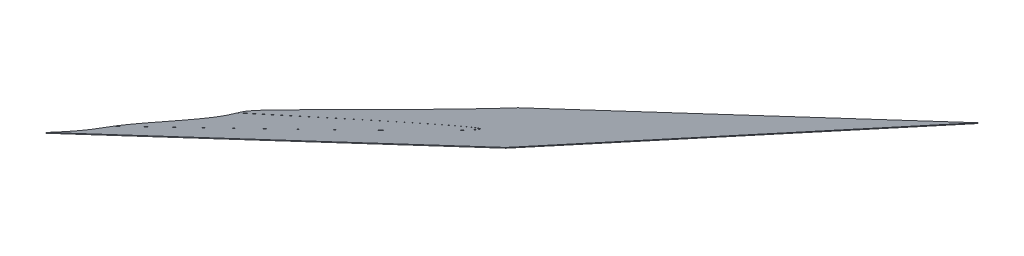
ISO-10303-21;
HEADER;
FILE_DESCRIPTION(('STEP AP214'),'2;1');
FILE_NAME('part.step','',(''),(''),'','','');
FILE_SCHEMA(('AUTOMOTIVE_DESIGN { 1 0 10303 214 1 1 1 1 }'));
ENDSEC;
DATA;
#1=APPLICATION_CONTEXT('core data for automotive mechanical design processes');
#2=APPLICATION_PROTOCOL_DEFINITION('international standard','automotive_design',2000,#1);
#3=PRODUCT_CONTEXT('',#1,'mechanical');
#4=PRODUCT('Part','Part','',(#3));
#5=PRODUCT_RELATED_PRODUCT_CATEGORY('part','',(#4));
#6=PRODUCT_DEFINITION_FORMATION('','',#4);
#7=PRODUCT_DEFINITION_CONTEXT('part definition',#1,'design');
#8=PRODUCT_DEFINITION('design','',#6,#7);
#9=PRODUCT_DEFINITION_SHAPE('','',#8);
#10=(LENGTH_UNIT() NAMED_UNIT(*) SI_UNIT(.MILLI.,.METRE.));
#11=(NAMED_UNIT(*) PLANE_ANGLE_UNIT() SI_UNIT($,.RADIAN.));
#12=(NAMED_UNIT(*) SI_UNIT($,.STERADIAN.) SOLID_ANGLE_UNIT());
#13=UNCERTAINTY_MEASURE_WITH_UNIT(LENGTH_MEASURE(1.E-05),#10,'distance_accuracy_value','');
#14=(GEOMETRIC_REPRESENTATION_CONTEXT(3) GLOBAL_UNCERTAINTY_ASSIGNED_CONTEXT((#13)) GLOBAL_UNIT_ASSIGNED_CONTEXT((#10,
#11,#12)) REPRESENTATION_CONTEXT('',''));
#15=CARTESIAN_POINT('',(0.,0.,0.));
#16=DIRECTION('',(0.,0.,1.));
#17=DIRECTION('',(1.,0.,0.));
#18=AXIS2_PLACEMENT_3D('',#15,#16,#17);
#19=CARTESIAN_POINT('',(1568.46992706819,389.379831950882,323.539097415844));
#20=CARTESIAN_POINT('',(1568.16414088397,389.714655714311,324.599592016166));
#21=CARTESIAN_POINT('',(1567.14624705832,390.171824813787,326.666592082493));
#22=CARTESIAN_POINT('',(1566.45869706116,390.311092375658,327.68544206741));
#23=CARTESIAN_POINT('',(1565.83932263441,390.436550548379,328.60326568454));
#24=CARTESIAN_POINT('',(1565.05166459567,390.498145343994,329.552452083646));
#25=CARTESIAN_POINT('',(1564.34024781227,390.553778079539,330.409762111201));
#26=CARTESIAN_POINT('',(1563.48214701023,390.558031169865,331.303950443254));
#27=CARTESIAN_POINT('',(1562.7161058719,390.561827975725,332.102207531619));
#28=CARTESIAN_POINT('',(1561.82054871175,390.524707212132,332.942927899901));
#29=CARTESIAN_POINT('',(1561.01430701408,390.491288566411,333.699801773673));
#30=CARTESIAN_POINT('',(1560.08314895562,390.423815124447,334.509671136521));
#31=CARTESIAN_POINT('',(1559.25747652285,390.363985366794,335.227794983459));
#32=CARTESIAN_POINT('',(1558.29560589706,390.27450240134,336.020342830274));
#33=CARTESIAN_POINT('',(1557.48892218456,390.199456497199,336.685022073266));
#34=CARTESIAN_POINT('',(1556.49137678576,390.094408169479,337.479707412954));
#35=CARTESIAN_POINT('',(1556.08494958628,390.051608615999,337.803483892161));
#36=CARTESIAN_POINT('',(1555.58481378326,389.997322579488,338.198310529932));
#37=CARTESIAN_POINT('',(1555.28610191312,389.964899618782,338.434125287923));
#38=CARTESIAN_POINT('',(1554.07095749592,389.831654406697,339.39040215781));
#39=CARTESIAN_POINT('',(1553.76753453117,389.798817208625,339.630152191706));
#40=CARTESIAN_POINT('',(1553.25119700232,389.742937859741,340.038136933886));
#41=CARTESIAN_POINT('',(1552.85983179049,389.702454506114,340.351539346196));
#42=CARTESIAN_POINT('',(1552.36048757215,389.650801656137,340.751410560781));
#43=CARTESIAN_POINT('',(1551.95601480371,389.612873698344,341.084014752642));
#44=CARTESIAN_POINT('',(1551.46334136448,389.566675044523,341.489147715582));
#45=CARTESIAN_POINT('',(1551.06038029617,389.536003290236,341.836343540348));
#46=CARTESIAN_POINT('',(1550.5738821321,389.498973032668,342.255515873876));
#47=CARTESIAN_POINT('',(1550.18366711276,389.4819272845,342.619897809679));
#48=CARTESIAN_POINT('',(1549.71062716311,389.461263497984,343.061621485145));
#49=CARTESIAN_POINT('',(1549.35005268598,389.468716683353,343.449970934165));
#50=CARTESIAN_POINT('',(1548.90655052278,389.477884009504,343.927635970491));
#51=CARTESIAN_POINT('',(1548.42674696526,389.561142596096,344.60763453266));
#52=CARTESIAN_POINT('',(1548.14581584088,389.658260267835,345.11343727996));
#53=CARTESIAN_POINT('',(1547.94392001205,389.80256098229,345.642768716615));
#54=CARTESIAN_POINT('',(1547.83849681698,389.99629074387,346.182649498274));
#55=CARTESIAN_POINT('',(1547.82946100776,390.232630565954,346.71799040574));
#56=CARTESIAN_POINT('',(1547.90164157936,390.499158571045,347.236785560455));
#57=CARTESIAN_POINT('',(1548.0890280721,390.903049279313,347.942530740097));
#58=CARTESIAN_POINT('',(1548.31590433077,391.238764710358,348.455822392337));
#59=CARTESIAN_POINT('',(1548.49744419471,391.507394553029,348.866543625364));
#60=CARTESIAN_POINT('',(1548.76118559021,391.846737621925,349.349900535017));
#61=CARTESIAN_POINT('',(1548.97312053249,392.119423878037,349.738312140087));
#62=CARTESIAN_POINT('',(1549.25565402692,392.460236002843,350.205563650248));
#63=CARTESIAN_POINT('',(1549.47916798983,392.729854544094,350.575209156958));
#64=CARTESIAN_POINT('',(1549.77708347704,393.078396941766,351.043806843739));
#65=B_SPLINE_CURVE_WITH_KNOTS('',2,(#19,#20,#21,#22,#23,#24,#25,#26,#27,#28,#29,#30,#31,#32,#33,
#34,#35,#36,#37,#38,#39,#40,#41,#42,#43,#44,#45,#46,#47,#48,#49,#50,#51,#52,#53,#54,#55,#56,#57,
#58,#59,#60,#61,#62,#63,#64),.UNSPECIFIED.,.F.,.F.,(3,1,2,2,2,2,2,2,2,2,1,2,2,2,2,2,2,1,1,1,1,1,
1,1,2,2,2,3),(0.,0.0625,0.125,0.1875,0.25,0.3125,0.375,0.4375,0.5,0.53125,0.5625,0.59375,0.625,
0.65625,0.6875,0.71875,0.75,0.78125,0.796875,0.8125,0.828125,0.84375,0.859375,0.875,0.90625,
0.9375,0.96875,1.),.UNSPECIFIED.);
#66=DIRECTION('',(0.389223194218151,-0.840232362196237,0.377511433735126));
#67=VECTOR('',#66,1.);
#68=SURFACE_OF_LINEAR_EXTRUSION('',#65,#67);
#69=CARTESIAN_POINT('',(1568.50884938761,389.295808714663,323.576848559218));
#70=CARTESIAN_POINT('',(1568.20306320339,389.630632478092,324.637343159539));
#71=CARTESIAN_POINT('',(1567.18516937774,390.087801577568,326.704343225867));
#72=CARTESIAN_POINT('',(1566.49761938058,390.227069139438,327.723193210784));
#73=CARTESIAN_POINT('',(1565.87824495383,390.352527312159,328.641016827914));
#74=CARTESIAN_POINT('',(1565.09058691509,390.414122107774,329.590203227019));
#75=CARTESIAN_POINT('',(1564.37917013169,390.46975484332,330.447513254575));
#76=CARTESIAN_POINT('',(1563.52106932965,390.474007933645,331.341701586627));
#77=CARTESIAN_POINT('',(1562.75502819133,390.477804739505,332.139958674992));
#78=CARTESIAN_POINT('',(1561.85947103117,390.440683975912,332.980679043275));
#79=CARTESIAN_POINT('',(1561.0532293335,390.407265330191,333.737552917047));
#80=CARTESIAN_POINT('',(1560.12207127504,390.339791888227,334.547422279895));
#81=CARTESIAN_POINT('',(1559.29639884228,390.279962130574,335.265546126833));
#82=CARTESIAN_POINT('',(1558.33452821648,390.19047916512,336.058093973648));
#83=CARTESIAN_POINT('',(1557.52784450398,390.11543326098,336.72277321664));
#84=CARTESIAN_POINT('',(1556.53029910518,390.01038493326,337.517458556327));
#85=CARTESIAN_POINT('',(1556.1238719057,389.96758537978,337.841235035535));
#86=CARTESIAN_POINT('',(1555.62373610269,389.913299343269,338.236061673305));
#87=CARTESIAN_POINT('',(1555.32502423254,389.880876382562,338.471876431297));
#88=CARTESIAN_POINT('',(1554.10987981534,389.747631170477,339.428153301184));
#89=CARTESIAN_POINT('',(1553.80645685059,389.714793972406,339.66790333508));
#90=CARTESIAN_POINT('',(1553.29011932174,389.658914623521,340.07588807726));
#91=CARTESIAN_POINT('',(1552.89875410991,389.618431269894,340.38929048957));
#92=CARTESIAN_POINT('',(1552.39940989157,389.566778419917,340.789161704154));
#93=CARTESIAN_POINT('',(1551.99493712313,389.528850462124,341.121765896015));
#94=CARTESIAN_POINT('',(1551.5022636839,389.482651808304,341.526898858955));
#95=CARTESIAN_POINT('',(1551.0993026156,389.451980054017,341.874094683722));
#96=CARTESIAN_POINT('',(1550.61280445152,389.414949796448,342.293267017249));
#97=CARTESIAN_POINT('',(1550.22258943218,389.397904048281,342.657648953053));
#98=CARTESIAN_POINT('',(1549.74954948253,389.377240261765,343.099372628518));
#99=CARTESIAN_POINT('',(1549.3889750054,389.384693447133,343.487722077538));
#100=CARTESIAN_POINT('',(1548.9454728422,389.393860773284,343.965387113864));
#101=CARTESIAN_POINT('',(1548.46566928468,389.477119359877,344.645385676033));
#102=CARTESIAN_POINT('',(1548.18473816031,389.574237031615,345.151188423334));
#103=CARTESIAN_POINT('',(1547.98284233147,389.71853774607,345.680519859989));
#104=CARTESIAN_POINT('',(1547.8774191364,389.91226750765,346.220400641647));
#105=CARTESIAN_POINT('',(1547.86838332719,390.148607329734,346.755741549113));
#106=CARTESIAN_POINT('',(1547.94056389878,390.415135334825,347.274536703828));
#107=CARTESIAN_POINT('',(1548.12795039153,390.819026043093,347.980281883471));
#108=CARTESIAN_POINT('',(1548.3548266502,391.154741474138,348.49357353571));
#109=CARTESIAN_POINT('',(1548.53636651413,391.423371316809,348.904294768738));
#110=CARTESIAN_POINT('',(1548.80010790963,391.762714385705,349.387651678391));
#111=CARTESIAN_POINT('',(1549.01204285191,392.035400641817,349.77606328346));
#112=CARTESIAN_POINT('',(1549.29457634634,392.376212766623,350.243314793622));
#113=CARTESIAN_POINT('',(1549.51809030925,392.645831307874,350.612960300331));
#114=CARTESIAN_POINT('',(1549.81600579646,392.994373705547,351.081557987113));
#115=B_SPLINE_CURVE_WITH_KNOTS('',2,(#69,#70,#71,#72,#73,#74,#75,#76,#77,#78,#79,#80,#81,#82,
#83,#84,#85,#86,#87,#88,#89,#90,#91,#92,#93,#94,#95,#96,#97,#98,#99,#100,#101,#102,#103,#104,
#105,#106,#107,#108,#109,#110,#111,#112,#113,#114),.UNSPECIFIED.,.F.,.F.,(3,1,2,2,2,2,2,2,2,2,1,
2,2,2,2,2,2,1,1,1,1,1,1,1,2,2,2,3),(0.,0.0625,0.125,0.1875,0.25,0.3125,0.375,0.4375,0.5,0.53125,
0.5625,0.59375,0.625,0.65625,0.6875,0.71875,0.75,0.78125,0.796875,0.8125,0.828125,0.84375,
0.859375,0.875,0.90625,0.9375,0.96875,1.),.UNSPECIFIED.);
#116=CARTESIAN_POINT('',(1568.50884938761,389.295808714662,323.576848559218));
#117=VERTEX_POINT('',#116);
#118=CARTESIAN_POINT('',(1549.81600545331,392.994373304075,351.081557447355));
#119=VERTEX_POINT('',#118);
#120=EDGE_CURVE('E183',#117,#119,#115,.T.);
#121=ORIENTED_EDGE('',*,*,#120,.T.);
#122=DIRECTION('',(0.389223194218151,-0.840232362196237,0.377511433735126));
#123=VECTOR('',#122,1.);
#124=CARTESIAN_POINT('',(1549.77708313389,393.078396540295,351.043806303981));
#125=LINE('',#124,#123);
#126=CARTESIAN_POINT('',(1549.77708313389,393.078396540295,351.043806303981));
#127=VERTEX_POINT('',#126);
#128=EDGE_CURVE('E13',#127,#119,#125,.T.);
#129=ORIENTED_EDGE('',*,*,#128,.F.);
#130=CARTESIAN_POINT('',(1568.46992706819,389.379831950882,323.539097415844));
#131=VERTEX_POINT('',#130);
#132=EDGE_CURVE('E251',#131,#127,#65,.T.);
#133=ORIENTED_EDGE('',*,*,#132,.F.);
#134=DIRECTION('',(0.389223194218151,-0.840232362196237,0.377511433735126));
#135=VECTOR('',#134,1.);
#136=CARTESIAN_POINT('',(1568.46992706819,389.379831950882,323.539097415844));
#137=LINE('',#136,#135);
#138=EDGE_CURVE('E182',#131,#117,#137,.T.);
#139=ORIENTED_EDGE('',*,*,#138,.T.);
#140=EDGE_LOOP('',(#121,#129,#133,#139));
#141=FACE_BOUND('',#140,.T.);
#142=ADVANCED_FACE('F58',(#141),#68,.F.);
#143=CARTESIAN_POINT('',(1549.77708347704,393.078396941765,351.043806843738));
#144=CARTESIAN_POINT('',(1550.51896713318,393.477868421516,351.168016429167));
#145=CARTESIAN_POINT('',(1551.48260946601,393.984764794518,351.302684641745));
#146=CARTESIAN_POINT('',(1552.24581598965,394.386227666691,351.409342117103));
#147=CARTESIAN_POINT('',(1553.1968685208,394.880733886271,351.529413778262));
#148=CARTESIAN_POINT('',(1554.56849032749,395.59391795561,351.702582876096));
#149=CARTESIAN_POINT('',(1556.63675708978,396.65907739575,351.940890987461));
#150=CARTESIAN_POINT('',(1557.75328108774,397.234088365448,352.069538186218));
#151=CARTESIAN_POINT('',(1562.39435123865,399.619090597236,352.59281746382));
#152=CARTESIAN_POINT('',(1563.52903471563,400.202932700363,352.722397385785));
#153=CARTESIAN_POINT('',(1565.41534047265,401.173515900582,352.937811955358));
#154=CARTESIAN_POINT('',(1566.97311378613,401.977874133011,353.121982040109));
#155=CARTESIAN_POINT('',(1568.79517709179,402.918698839167,353.337398205299));
#156=CARTESIAN_POINT('',(1570.59908323614,403.855229280311,353.561977027764));
#157=CARTESIAN_POINT('',(1574.1445289118,405.697247476923,354.006343991916));
#158=CARTESIAN_POINT('',(1577.1172601634,407.265979854291,354.432937052148));
#159=CARTESIAN_POINT('',(1577.45184742729,407.442716746908,354.481335409242));
#160=CARTESIAN_POINT('',(1580.98923558462,409.313600398953,354.998256103897));
#161=CARTESIAN_POINT('',(1583.91934112642,410.90603376474,355.52154889067));
#162=CARTESIAN_POINT('',(1584.25487862614,411.088702844731,355.582170882787));
#163=CARTESIAN_POINT('',(1587.84136275895,413.045714246255,356.240168178674));
#164=CARTESIAN_POINT('',(1590.61626721705,414.641951335117,356.931942942637));
#165=CARTESIAN_POINT('',(1592.55161715252,415.759186470631,357.423197025712));
#166=CARTESIAN_POINT('',(1594.00834400245,416.648873129688,357.901465044596));
#167=CARTESIAN_POINT('',(1595.82081584295,417.755828779251,358.496530149956));
#168=CARTESIAN_POINT('',(1597.1198544099,418.642445106104,359.130544828308));
#169=CARTESIAN_POINT('',(1598.93142482296,419.878873297178,360.014708133365));
#170=CARTESIAN_POINT('',(1599.76626577104,420.70199686166,360.986004798115));
#171=CARTESIAN_POINT('',(1600.3973079293,421.324182047775,361.720191525606));
#172=CARTESIAN_POINT('',(1600.56244896092,422.141934856876,363.370010839682));
#173=CARTESIAN_POINT('',(1599.99491435774,422.297979111334,364.302462236262));
#174=B_SPLINE_CURVE_WITH_KNOTS('',2,(#143,#144,#145,#146,#147,#148,#149,#150,#151,#152,#153,
#154,#155,#156,#157,#158,#159,#160,#161,#162,#163,#164,#165,#166,#167,#168,#169,#170,#171,#172,
#173),.UNSPECIFIED.,.F.,.F.,(3,2,2,2,1,2,2,1,1,1,1,1,1,1,1,1,1,2,2,2,1,3),(0.,0.03125,0.0625,
0.125,0.1875,0.25,0.3125,0.375,0.38125,0.4940625,0.5,0.50625,0.6190625,0.625,0.63125,0.7440625,
0.75,0.8125,0.875,0.936641693115234,0.968320846557617,1.),.UNSPECIFIED.);
#175=DIRECTION('',(0.389223194218151,-0.840232362196237,0.377511433735126));
#176=VECTOR('',#175,1.);
#177=SURFACE_OF_LINEAR_EXTRUSION('',#174,#176);
#178=CARTESIAN_POINT('',(1549.81600579646,392.994373705546,351.081557987112));
#179=CARTESIAN_POINT('',(1550.55788945261,393.393845185296,351.20576757254));
#180=CARTESIAN_POINT('',(1551.52153178543,393.900741558298,351.340435785118));
#181=CARTESIAN_POINT('',(1552.28473830907,394.302204430472,351.447093260476));
#182=CARTESIAN_POINT('',(1553.23579084022,394.796710650052,351.567164921636));
#183=CARTESIAN_POINT('',(1554.60741264691,395.509894719391,351.74033401947));
#184=CARTESIAN_POINT('',(1556.6756794092,396.57505415953,351.978642130835));
#185=CARTESIAN_POINT('',(1557.79220340717,397.150065129229,352.107289329591));
#186=CARTESIAN_POINT('',(1562.43327355807,399.535067361017,352.630568607194));
#187=CARTESIAN_POINT('',(1563.56795703505,400.118909464144,352.760148529158));
#188=CARTESIAN_POINT('',(1565.45426279208,401.089492664363,352.975563098732));
#189=CARTESIAN_POINT('',(1567.01203610556,401.893850896791,353.159733183483));
#190=CARTESIAN_POINT('',(1568.83409941121,402.834675602948,353.375149348672));
#191=CARTESIAN_POINT('',(1570.63800555557,403.771206044091,353.599728171138));
#192=CARTESIAN_POINT('',(1574.18345123122,405.613224240703,354.044095135289));
#193=CARTESIAN_POINT('',(1577.15618248283,407.181956618071,354.470688195521));
#194=CARTESIAN_POINT('',(1577.49076974671,407.358693510688,354.519086552615));
#195=CARTESIAN_POINT('',(1581.02815790404,409.229577162734,355.036007247271));
#196=CARTESIAN_POINT('',(1583.95826344584,410.822010528521,355.559300034043));
#197=CARTESIAN_POINT('',(1584.29380094556,411.004679608512,355.619922026161));
#198=CARTESIAN_POINT('',(1587.88028507837,412.961691010036,356.277919322048));
#199=CARTESIAN_POINT('',(1590.65518953648,414.557928098897,356.969694086011));
#200=CARTESIAN_POINT('',(1592.59053947194,415.675163234411,357.460948169086));
#201=CARTESIAN_POINT('',(1594.04726632188,416.564849893468,357.93921618797));
#202=CARTESIAN_POINT('',(1595.85973816237,417.671805543031,358.53428129333));
#203=CARTESIAN_POINT('',(1597.15877672932,418.558421869884,359.168295971682));
#204=CARTESIAN_POINT('',(1598.97034714238,419.794850060958,360.052459276739));
#205=CARTESIAN_POINT('',(1599.80518809046,420.617973625441,361.023755941488));
#206=CARTESIAN_POINT('',(1600.43623024873,421.240158811555,361.75794266898));
#207=CARTESIAN_POINT('',(1600.60137128034,422.057911620656,363.407761983056));
#208=CARTESIAN_POINT('',(1600.03383667716,422.213955875114,364.340213379636));
#209=B_SPLINE_CURVE_WITH_KNOTS('',2,(#178,#179,#180,#181,#182,#183,#184,#185,#186,#187,#188,
#189,#190,#191,#192,#193,#194,#195,#196,#197,#198,#199,#200,#201,#202,#203,#204,#205,#206,#207,
#208),.UNSPECIFIED.,.F.,.F.,(3,2,2,2,1,2,2,1,1,1,1,1,1,1,1,1,1,2,2,2,1,3),(0.,0.03125,0.0625,
0.125,0.1875,0.25,0.3125,0.375,0.38125,0.4940625,0.5,0.50625,0.6190625,0.625,0.63125,0.7440625,
0.75,0.8125,0.875,0.936641693115234,0.968320846557617,1.),.UNSPECIFIED.);
#210=CARTESIAN_POINT('',(1600.03383616133,422.213955650202,364.340213410876));
#211=VERTEX_POINT('',#210);
#212=EDGE_CURVE('E188',#119,#211,#209,.T.);
#213=ORIENTED_EDGE('',*,*,#212,.T.);
#214=DIRECTION('',(0.389223194218151,-0.840232362196237,0.377511433735126));
#215=VECTOR('',#214,1.);
#216=CARTESIAN_POINT('',(1599.99491384191,422.297978886421,364.302462267503));
#217=LINE('',#216,#215);
#218=CARTESIAN_POINT('',(1599.99491384191,422.297978886421,364.302462267503));
#219=VERTEX_POINT('',#218);
#220=EDGE_CURVE('E67',#219,#211,#217,.T.);
#221=ORIENTED_EDGE('',*,*,#220,.F.);
#222=EDGE_CURVE('E129',#127,#219,#174,.T.);
#223=ORIENTED_EDGE('',*,*,#222,.F.);
#224=ORIENTED_EDGE('',*,*,#128,.T.);
#225=EDGE_LOOP('',(#213,#221,#223,#224));
#226=FACE_BOUND('',#225,.T.);
#227=ADVANCED_FACE('F324',(#226),#177,.F.);
#228=CARTESIAN_POINT('',(1599.99491435774,422.297979111334,364.302462236262));
#229=DIRECTION('',(-0.104077618977063,0.367090304717217,0.924344393292179));
#230=DIRECTION('',(0.,-0.929391754760672,0.369094792950102));
#231=AXIS2_PLACEMENT_3D('',#228,#229,#230);
#232=PLANE('',#231);
#233=CARTESIAN_POINT('',(1600.03383667716,422.213955875114,364.340213379636));
#234=CARTESIAN_POINT('',(1599.80002470653,422.112008744247,364.354373913565));
#235=B_SPLINE_CURVE_WITH_KNOTS('',1,(#233,#234),.UNSPECIFIED.,.F.,.F.,(2,2),(0.,1.),.UNSPECIFIED.);
#236=CARTESIAN_POINT('',(1599.80002522189,422.112008968956,364.354373882353));
#237=VERTEX_POINT('',#236);
#238=EDGE_CURVE('E195',#211,#237,#235,.T.);
#239=ORIENTED_EDGE('',*,*,#238,.T.);
#240=DIRECTION('',(0.389223194218151,-0.840232362196237,0.377511433735126));
#241=VECTOR('',#240,1.);
#242=CARTESIAN_POINT('',(1599.76110290247,422.196032205175,364.31662273898));
#243=LINE('',#242,#241);
#244=CARTESIAN_POINT('',(1599.76110290247,422.196032205175,364.31662273898));
#245=VERTEX_POINT('',#244);
#246=EDGE_CURVE('E270',#245,#237,#243,.T.);
#247=ORIENTED_EDGE('',*,*,#246,.F.);
#248=CARTESIAN_POINT('',(1599.99491435774,422.297979111334,364.302462236262));
#249=CARTESIAN_POINT('',(1599.76110238711,422.196031980466,364.316622770192));
#250=B_SPLINE_CURVE_WITH_KNOTS('',1,(#248,#249),.UNSPECIFIED.,.F.,.F.,(2,2),(0.,1.),.UNSPECIFIED.);
#251=EDGE_CURVE('E278',#219,#245,#250,.T.);
#252=ORIENTED_EDGE('',*,*,#251,.F.);
#253=ORIENTED_EDGE('',*,*,#220,.T.);
#254=EDGE_LOOP('',(#239,#247,#252,#253));
#255=FACE_BOUND('',#254,.T.);
#256=ADVANCED_FACE('F276',(#255),#232,.F.);
#257=CARTESIAN_POINT('',(1599.76110238711,422.196031980466,364.316622770192));
#258=CARTESIAN_POINT('',(1600.04147449859,422.118244349511,363.85441951457));
#259=CARTESIAN_POINT('',(1600.27951564195,421.829290411887,362.96586474835));
#260=CARTESIAN_POINT('',(1600.1596909371,421.231365323625,361.758596797683));
#261=CARTESIAN_POINT('',(1599.53207141102,420.609853493109,361.022379952425));
#262=CARTESIAN_POINT('',(1598.6814755543,419.773409883672,360.037680363902));
#263=CARTESIAN_POINT('',(1596.85142954419,418.527648580034,359.151792998964));
#264=CARTESIAN_POINT('',(1595.56161885265,417.649639918147,358.527422361025));
#265=CARTESIAN_POINT('',(1593.77043576017,416.556738085744,357.941687827332));
#266=CARTESIAN_POINT('',(1592.33071723231,415.678284607793,357.470885671985));
#267=CARTESIAN_POINT('',(1590.41522017393,414.573051490806,356.9858758611));
#268=CARTESIAN_POINT('',(1587.65376628701,412.985620375725,356.299832817223));
#269=CARTESIAN_POINT('',(1584.11656837556,411.057063084543,355.654350967009));
#270=CARTESIAN_POINT('',(1583.78647566277,410.877485580002,355.594996232888));
#271=CARTESIAN_POINT('',(1580.87537711127,409.296672627119,355.077970502676));
#272=CARTESIAN_POINT('',(1577.40904907639,407.465768926626,354.576769070431));
#273=CARTESIAN_POINT('',(1577.07935732693,407.291840529245,354.529574228741));
#274=CARTESIAN_POINT('',(1574.10238538172,405.723026144101,354.107170897829));
#275=CARTESIAN_POINT('',(1570.66085360164,403.939424027505,353.685683724252));
#276=CARTESIAN_POINT('',(1570.33126059082,403.768739384676,353.645606749569));
#277=CARTESIAN_POINT('',(1567.32914430123,402.215100084182,353.282903224404));
#278=CARTESIAN_POINT('',(1563.88287465823,400.4503722563,352.908309661845));
#279=CARTESIAN_POINT('',(1563.5540228946,400.282058794414,352.872746013689));
#280=CARTESIAN_POINT('',(1560.56657512629,398.753674112801,352.551128447745));
#281=CARTESIAN_POINT('',(1557.08191144957,396.982608882843,352.202014797226));
#282=CARTESIAN_POINT('',(1556.75689060347,396.817467168191,352.169560783918));
#283=CARTESIAN_POINT('',(1553.72544238751,395.277590954325,351.867731857007));
#284=CARTESIAN_POINT('',(1550.08246822978,393.434017025568,351.520456444392));
#285=B_SPLINE_CURVE_WITH_KNOTS('',2,(#257,#258,#259,#260,#261,#262,#263,#264,#265,#266,#267,
#268,#269,#270,#271,#272,#273,#274,#275,#276,#277,#278,#279,#280,#281,#282,#283,#284),
.UNSPECIFIED.,.F.,.F.,(3,1,1,1,1,2,2,1,1,1,1,1,1,1,1,1,1,1,1,1,1,1,1,1,3),(0.,0.015625,0.03125,
0.0625,0.0629358291625977,0.125,0.1875,0.25,0.25625,0.3690625,0.375,0.38125,0.4940625,0.5,
0.50625,0.6190625,0.625,0.63125,0.7440625,0.75,0.75625,0.8690625,0.875,0.88125,1.),.UNSPECIFIED.);
#286=DIRECTION('',(0.389223194218151,-0.840232362196237,0.377511433735126));
#287=VECTOR('',#286,1.);
#288=SURFACE_OF_LINEAR_EXTRUSION('',#285,#287);
#289=CARTESIAN_POINT('',(1599.80002470653,422.112008744247,364.354373913565));
#290=CARTESIAN_POINT('',(1600.08039681801,422.034221113292,363.892170657943));
#291=CARTESIAN_POINT('',(1600.31843796137,421.745267175668,363.003615891724));
#292=CARTESIAN_POINT('',(1600.19861325652,421.147342087405,361.796347941056));
#293=CARTESIAN_POINT('',(1599.57099373044,420.525830256889,361.060131095799));
#294=CARTESIAN_POINT('',(1598.72039787372,419.689386647453,360.075431507276));
#295=CARTESIAN_POINT('',(1596.89035186361,418.443625343815,359.189544142337));
#296=CARTESIAN_POINT('',(1595.60054117207,417.565616681927,358.565173504398));
#297=CARTESIAN_POINT('',(1593.80935807959,416.472714849524,357.979438970706));
#298=CARTESIAN_POINT('',(1592.36963955173,415.594261371573,357.508636815358));
#299=CARTESIAN_POINT('',(1590.45414249335,414.489028254587,357.023627004473));
#300=CARTESIAN_POINT('',(1587.69268860643,412.901597139505,356.337583960596));
#301=CARTESIAN_POINT('',(1584.15549069498,410.973039848323,355.692102110382));
#302=CARTESIAN_POINT('',(1583.82539798219,410.793462343783,355.632747376261));
#303=CARTESIAN_POINT('',(1580.91429943069,409.2126493909,355.115721646049));
#304=CARTESIAN_POINT('',(1577.44797139581,407.381745690406,354.614520213805));
#305=CARTESIAN_POINT('',(1577.11827964635,407.207817293025,354.567325372115));
#306=CARTESIAN_POINT('',(1574.14130770115,405.639002907882,354.144922041203));
#307=CARTESIAN_POINT('',(1570.69977592106,403.855400791285,353.723434867625));
#308=CARTESIAN_POINT('',(1570.37018291024,403.684716148456,353.683357892943));
#309=CARTESIAN_POINT('',(1567.36806662065,402.131076847962,353.320654367777));
#310=CARTESIAN_POINT('',(1563.92179697765,400.366349020081,352.946060805219));
#311=CARTESIAN_POINT('',(1563.59294521402,400.198035558194,352.910497157063));
#312=CARTESIAN_POINT('',(1560.60549744571,398.669650876582,352.588879591118));
#313=CARTESIAN_POINT('',(1557.12083376899,396.898585646623,352.2397659406));
#314=CARTESIAN_POINT('',(1556.7958129229,396.733443931971,352.207311927291));
#315=CARTESIAN_POINT('',(1553.76436470693,395.193567718105,351.905483000381));
#316=CARTESIAN_POINT('',(1550.1213905492,393.349993789348,351.558207587766));
#317=B_SPLINE_CURVE_WITH_KNOTS('',2,(#289,#290,#291,#292,#293,#294,#295,#296,#297,#298,#299,
#300,#301,#302,#303,#304,#305,#306,#307,#308,#309,#310,#311,#312,#313,#314,#315,#316),
.UNSPECIFIED.,.F.,.F.,(3,1,1,1,1,2,2,1,1,1,1,1,1,1,1,1,1,1,1,1,1,1,1,1,3),(0.,0.015625,0.03125,
0.0625,0.0629358291625977,0.125,0.1875,0.25,0.25625,0.3690625,0.375,0.38125,0.4940625,0.5,
0.50625,0.6190625,0.625,0.63125,0.7440625,0.75,0.75625,0.8690625,0.875,0.88125,1.),.UNSPECIFIED.);
#318=CARTESIAN_POINT('',(1550.12139117828,393.349994107704,351.558207647735));
#319=VERTEX_POINT('',#318);
#320=EDGE_CURVE('E202',#237,#319,#317,.T.);
#321=ORIENTED_EDGE('',*,*,#320,.T.);
#322=DIRECTION('',(0.389223194218151,-0.840232362196237,0.377511433735126));
#323=VECTOR('',#322,1.);
#324=CARTESIAN_POINT('',(1550.08246885886,393.434017343924,351.520456504361));
#325=LINE('',#324,#323);
#326=CARTESIAN_POINT('',(1550.08246885886,393.434017343924,351.520456504361));
#327=VERTEX_POINT('',#326);
#328=EDGE_CURVE('E267',#327,#319,#325,.T.);
#329=ORIENTED_EDGE('',*,*,#328,.F.);
#330=EDGE_CURVE('E296',#245,#327,#285,.T.);
#331=ORIENTED_EDGE('',*,*,#330,.F.);
#332=ORIENTED_EDGE('',*,*,#246,.T.);
#333=EDGE_LOOP('',(#321,#329,#331,#332));
#334=FACE_BOUND('',#333,.T.);
#335=ADVANCED_FACE('F287',(#334),#288,.F.);
#336=CARTESIAN_POINT('',(1550.08246822978,393.434017025568,351.520456444392));
#337=CARTESIAN_POINT('',(1550.2157168989,393.588601723431,351.727135199661));
#338=CARTESIAN_POINT('',(1550.61316750413,394.047884207109,352.339585555872));
#339=CARTESIAN_POINT('',(1550.93994782399,394.425502142393,352.843136741024));
#340=CARTESIAN_POINT('',(1551.13877162411,394.656652350566,353.152618892887));
#341=CARTESIAN_POINT('',(1551.72556538379,395.338851864006,354.066001472502));
#342=CARTESIAN_POINT('',(1552.16460772112,395.867118030866,354.789107699022));
#343=CARTESIAN_POINT('',(1552.699598314,396.510831417424,355.670241466649));
#344=CARTESIAN_POINT('',(1553.6293260612,397.699378023441,357.357034665289));
#345=CARTESIAN_POINT('',(1554.47120719459,398.872747195367,359.100619172532));
#346=CARTESIAN_POINT('',(1555.2108455127,400.030457886337,360.914767139111));
#347=CARTESIAN_POINT('',(1555.82348111235,401.147656406597,362.769689412076));
#348=CARTESIAN_POINT('',(1556.31207136253,402.220638134044,364.654091446123));
#349=CARTESIAN_POINT('',(1556.51905520395,402.787869180434,365.703180121906));
#350=CARTESIAN_POINT('',(1556.71016585474,403.317026717926,366.683893702125));
#351=CARTESIAN_POINT('',(1556.87121096811,403.878821311384,367.768246302624));
#352=CARTESIAN_POINT('',(1556.94190273727,404.125424594642,368.244229721841));
#353=CARTESIAN_POINT('',(1557.07473640013,404.634479979636,369.240286615652));
#354=CARTESIAN_POINT('',(1557.14634090849,404.926565665407,369.816559784651));
#355=CARTESIAN_POINT('',(1557.18056822031,405.066184078744,370.092021231152));
#356=CARTESIAN_POINT('',(1557.27210790607,405.446224598842,370.843503039899));
#357=CARTESIAN_POINT('',(1557.35057659046,405.771998927014,371.487680353713));
#358=CARTESIAN_POINT('',(1557.39821769043,405.963626609973,371.865069611041));
#359=CARTESIAN_POINT('',(1557.46932035064,406.249624163319,372.428309757707));
#360=CARTESIAN_POINT('',(1557.60743828869,406.764430112364,373.431717548208));
#361=CARTESIAN_POINT('',(1557.85037107345,407.576376808377,374.988408984247));
#362=CARTESIAN_POINT('',(1558.26234901576,408.644895825113,376.941867398823));
#363=CARTESIAN_POINT('',(1558.80408187855,409.754208187048,378.852339735724));
#364=CARTESIAN_POINT('',(1559.47053145911,410.893316172509,380.700542721223));
#365=CARTESIAN_POINT('',(1559.88395455515,411.519062374568,381.667025637724));
#366=B_SPLINE_CURVE_WITH_KNOTS('',2,(#336,#337,#338,#339,#340,#341,#342,#343,#344,#345,#346,
#347,#348,#349,#350,#351,#352,#353,#354,#355,#356,#357,#358,#359,#360,#361,#362,#363,#364,#365),
.UNSPECIFIED.,.F.,.F.,(3,2,2,2,1,1,1,1,1,1,1,2,1,2,2,2,1,1,1,1,1,3),(0.,0.03125,0.0625,0.125,
0.1875,0.25,0.3125,0.375,0.4361572265625,0.497314453125,0.5,0.5625,0.59375,0.625,0.65625,0.6875,
0.71875,0.75,0.8125,0.875,0.9375,1.),.UNSPECIFIED.);
#367=DIRECTION('',(0.389223194218151,-0.840232362196237,0.377511433735126));
#368=VECTOR('',#367,1.);
#369=SURFACE_OF_LINEAR_EXTRUSION('',#366,#368);
#370=CARTESIAN_POINT('',(1550.1213905492,393.349993789348,351.558207587766));
#371=CARTESIAN_POINT('',(1550.25463921832,393.504578487211,351.764886343035));
#372=CARTESIAN_POINT('',(1550.65208982355,393.963860970889,352.377336699245));
#373=CARTESIAN_POINT('',(1550.97887014341,394.341478906173,352.880887884398));
#374=CARTESIAN_POINT('',(1551.17769394354,394.572629114346,353.190370036261));
#375=CARTESIAN_POINT('',(1551.76448770321,395.254828627786,354.103752615875));
#376=CARTESIAN_POINT('',(1552.20353004054,395.783094794646,354.826858842395));
#377=CARTESIAN_POINT('',(1552.73852063342,396.426808181205,355.707992610023));
#378=CARTESIAN_POINT('',(1553.66824838062,397.615354787222,357.394785808663));
#379=CARTESIAN_POINT('',(1554.51012951401,398.788723959148,359.138370315906));
#380=CARTESIAN_POINT('',(1555.24976783212,399.946434650118,360.952518282485));
#381=CARTESIAN_POINT('',(1555.86240343177,401.063633170377,362.80744055545));
#382=CARTESIAN_POINT('',(1556.35099368195,402.136614897825,364.691842589497));
#383=CARTESIAN_POINT('',(1556.55797752337,402.703845944215,365.740931265279));
#384=CARTESIAN_POINT('',(1556.74908817416,403.233003481706,366.721644845498));
#385=CARTESIAN_POINT('',(1556.91013328754,403.794798075165,367.805997445998));
#386=CARTESIAN_POINT('',(1556.98082505669,404.041401358423,368.281980865215));
#387=CARTESIAN_POINT('',(1557.11365871955,404.550456743417,369.278037759026));
#388=CARTESIAN_POINT('',(1557.18526322791,404.842542429187,369.854310928025));
#389=CARTESIAN_POINT('',(1557.21949053974,404.982160842524,370.129772374525));
#390=CARTESIAN_POINT('',(1557.31103022549,405.362201362623,370.881254183272));
#391=CARTESIAN_POINT('',(1557.38949890988,405.687975690794,371.525431497086));
#392=CARTESIAN_POINT('',(1557.43714000985,405.879603373753,371.902820754414));
#393=CARTESIAN_POINT('',(1557.50824267006,406.165600927099,372.46606090108));
#394=CARTESIAN_POINT('',(1557.64636060811,406.680406876145,373.469468691581));
#395=CARTESIAN_POINT('',(1557.88929339287,407.492353572157,375.02616012762));
#396=CARTESIAN_POINT('',(1558.30127133519,408.560872588893,376.979618542197));
#397=CARTESIAN_POINT('',(1558.84300419797,409.670184950828,378.890090879098));
#398=CARTESIAN_POINT('',(1559.50945377853,410.809292936289,380.738293864596));
#399=CARTESIAN_POINT('',(1559.92287687457,411.435039138349,381.704776781098));
#400=B_SPLINE_CURVE_WITH_KNOTS('',2,(#370,#371,#372,#373,#374,#375,#376,#377,#378,#379,#380,
#381,#382,#383,#384,#385,#386,#387,#388,#389,#390,#391,#392,#393,#394,#395,#396,#397,#398,#399),
.UNSPECIFIED.,.F.,.F.,(3,2,2,2,1,1,1,1,1,1,1,2,1,2,2,2,1,1,1,1,1,3),(0.,0.03125,0.0625,0.125,
0.1875,0.25,0.3125,0.375,0.4361572265625,0.497314453125,0.5,0.5625,0.59375,0.625,0.65625,0.6875,
0.71875,0.75,0.8125,0.875,0.9375,1.),.UNSPECIFIED.);
#401=CARTESIAN_POINT('',(1559.92287670091,411.435038875506,381.704776375129));
#402=VERTEX_POINT('',#401);
#403=EDGE_CURVE('E209',#319,#402,#400,.T.);
#404=ORIENTED_EDGE('',*,*,#403,.T.);
#405=DIRECTION('',(0.389223194218151,-0.840232362196237,0.377511433735126));
#406=VECTOR('',#405,1.);
#407=CARTESIAN_POINT('',(1559.88395438149,411.519062111725,381.667025231756));
#408=LINE('',#407,#406);
#409=CARTESIAN_POINT('',(1559.88395438149,411.519062111725,381.667025231756));
#410=VERTEX_POINT('',#409);
#411=EDGE_CURVE('E264',#410,#402,#408,.T.);
#412=ORIENTED_EDGE('',*,*,#411,.F.);
#413=EDGE_CURVE('E293',#327,#410,#366,.T.);
#414=ORIENTED_EDGE('',*,*,#413,.F.);
#415=ORIENTED_EDGE('',*,*,#328,.T.);
#416=EDGE_LOOP('',(#404,#412,#414,#415));
#417=FACE_BOUND('',#416,.T.);
#418=ADVANCED_FACE('F291',(#417),#369,.F.);
#419=CARTESIAN_POINT('',(1559.88395455515,411.519062374568,381.667025637724));
#420=CARTESIAN_POINT('',(1565.29836158611,413.259445553913,379.95823890484));
#421=CARTESIAN_POINT('',(1569.8982079223,414.702364763776,378.42721383891));
#422=CARTESIAN_POINT('',(1570.41183782002,414.863221797382,378.25567099721));
#423=CARTESIAN_POINT('',(1575.80967170329,416.550157808547,376.445013477235));
#424=CARTESIAN_POINT('',(1580.10268174844,417.827350063235,374.861483114896));
#425=CARTESIAN_POINT('',(1580.45144673593,417.930759073742,374.732057034191));
#426=CARTESIAN_POINT('',(1583.04148519832,418.697007785754,373.767116516895));
#427=CARTESIAN_POINT('',(1585.27333596869,419.326469565057,372.867027412927));
#428=CARTESIAN_POINT('',(1585.52393093965,419.396933751461,372.765491189558));
#429=CARTESIAN_POINT('',(1588.16328289459,420.136203277354,371.689659354459));
#430=CARTESIAN_POINT('',(1590.32295663606,420.688692259935,370.692667063444));
#431=CARTESIAN_POINT('',(1590.57540454241,420.752875916659,370.575241759162));
#432=CARTESIAN_POINT('',(1593.30919114251,421.441883753867,369.290177448985));
#433=CARTESIAN_POINT('',(1595.28047496675,421.828234132357,368.117642643229));
#434=CARTESIAN_POINT('',(1596.73721409997,422.107673512515,367.237662281288));
#435=CARTESIAN_POINT('',(1597.71441437166,422.213908963868,366.46659544494));
#436=CARTESIAN_POINT('',(1599.07057618082,422.361342878983,365.396506307567));
#437=CARTESIAN_POINT('',(1599.69970886851,422.211807478035,364.41503267697));
#438=B_SPLINE_CURVE_WITH_KNOTS('',2,(#419,#420,#421,#422,#423,#424,#425,#426,#427,#428,#429,
#430,#431,#432,#433,#434,#435,#436,#437),.UNSPECIFIED.,.F.,.F.,(3,1,1,1,1,1,1,1,1,1,1,1,1,1,1,2,
3),(0.,0.2375,0.25,0.2625,0.488125,0.5,0.50625,0.6190625,0.625,0.63125,0.7440625,0.75,0.75625,
0.8690625,0.875,0.9375,1.),.UNSPECIFIED.);
#439=DIRECTION('',(0.389223194218151,-0.840232362196237,0.377511433735126));
#440=VECTOR('',#439,1.);
#441=SURFACE_OF_LINEAR_EXTRUSION('',#438,#440);
#442=CARTESIAN_POINT('',(1559.92287687457,411.435039138349,381.704776781098));
#443=CARTESIAN_POINT('',(1565.33728390553,413.175422317693,379.995990048213));
#444=CARTESIAN_POINT('',(1569.93713024172,414.618341527556,378.464964982284));
#445=CARTESIAN_POINT('',(1570.45076013945,414.779198561162,378.293422140584));
#446=CARTESIAN_POINT('',(1575.84859402271,416.466134572327,376.482764620608));
#447=CARTESIAN_POINT('',(1580.14160406787,417.743326827015,374.89923425827));
#448=CARTESIAN_POINT('',(1580.49036905535,417.846735837522,374.769808177565));
#449=CARTESIAN_POINT('',(1583.08040751774,418.612984549534,373.804867660269));
#450=CARTESIAN_POINT('',(1585.31225828811,419.242446328837,372.904778556301));
#451=CARTESIAN_POINT('',(1585.56285325908,419.312910515242,372.803242332932));
#452=CARTESIAN_POINT('',(1588.20220521401,420.052180041134,371.727410497833));
#453=CARTESIAN_POINT('',(1590.36187895549,420.604669023715,370.730418206817));
#454=CARTESIAN_POINT('',(1590.61432686183,420.66885268044,370.612992902535));
#455=CARTESIAN_POINT('',(1593.34811346194,421.357860517647,369.327928592359));
#456=CARTESIAN_POINT('',(1595.31939728617,421.744210896137,368.155393786602));
#457=CARTESIAN_POINT('',(1596.7761364194,422.023650276295,367.275413424662));
#458=CARTESIAN_POINT('',(1597.75333669108,422.129885727649,366.504346588314));
#459=CARTESIAN_POINT('',(1599.10949850024,422.277319642763,365.434257450941));
#460=CARTESIAN_POINT('',(1599.73863118793,422.127784241816,364.452783820344));
#461=B_SPLINE_CURVE_WITH_KNOTS('',2,(#442,#443,#444,#445,#446,#447,#448,#449,#450,#451,#452,
#453,#454,#455,#456,#457,#458,#459,#460),.UNSPECIFIED.,.F.,.F.,(3,1,1,1,1,1,1,1,1,1,1,1,1,1,1,2,
3),(0.,0.2375,0.25,0.2625,0.488125,0.5,0.50625,0.6190625,0.625,0.63125,0.7440625,0.75,0.75625,
0.8690625,0.875,0.9375,1.),.UNSPECIFIED.);
#462=CARTESIAN_POINT('',(1599.73863088183,422.127784314572,364.45278429788));
#463=VERTEX_POINT('',#462);
#464=EDGE_CURVE('E216',#402,#463,#461,.T.);
#465=ORIENTED_EDGE('',*,*,#464,.T.);
#466=DIRECTION('',(0.389223194218151,-0.840232362196237,0.377511433735126));
#467=VECTOR('',#466,1.);
#468=CARTESIAN_POINT('',(1599.6997085624,422.211807550792,364.415033154507));
#469=LINE('',#468,#467);
#470=CARTESIAN_POINT('',(1599.6997085624,422.211807550792,364.415033154507));
#471=VERTEX_POINT('',#470);
#472=EDGE_CURVE('E261',#471,#463,#469,.T.);
#473=ORIENTED_EDGE('',*,*,#472,.F.);
#474=EDGE_CURVE('E295',#410,#471,#438,.T.);
#475=ORIENTED_EDGE('',*,*,#474,.F.);
#476=ORIENTED_EDGE('',*,*,#411,.T.);
#477=EDGE_LOOP('',(#465,#473,#475,#476));
#478=FACE_BOUND('',#477,.T.);
#479=ADVANCED_FACE('F319',(#478),#441,.F.);
#480=CARTESIAN_POINT('',(1599.69970886851,422.211807478035,364.41503267697));
#481=DIRECTION('',(0.104159281489005,-0.36705469643481,-0.924349335427274));
#482=DIRECTION('',(0.,0.929404712785673,-0.369062162584816));
#483=AXIS2_PLACEMENT_3D('',#480,#481,#482);
#484=PLANE('',#483);
#485=CARTESIAN_POINT('',(1599.73863118793,422.127784241816,364.452783820343));
#486=CARTESIAN_POINT('',(1599.97222852567,422.229647181293,364.438657192054));
#487=B_SPLINE_CURVE_WITH_KNOTS('',1,(#485,#486),.UNSPECIFIED.,.F.,.F.,(2,2),(0.,1.),.UNSPECIFIED.);
#488=CARTESIAN_POINT('',(1599.97222800182,422.229646952861,364.438657223734));
#489=VERTEX_POINT('',#488);
#490=EDGE_CURVE('E223',#463,#489,#487,.T.);
#491=ORIENTED_EDGE('',*,*,#490,.T.);
#492=DIRECTION('',(0.389223194218151,-0.840232362196237,0.377511433735126));
#493=VECTOR('',#492,1.);
#494=CARTESIAN_POINT('',(1599.9333056824,422.313670189081,364.40090608036));
#495=LINE('',#494,#493);
#496=CARTESIAN_POINT('',(1599.9333056824,422.313670189081,364.40090608036));
#497=VERTEX_POINT('',#496);
#498=EDGE_CURVE('E258',#497,#489,#495,.T.);
#499=ORIENTED_EDGE('',*,*,#498,.F.);
#500=CARTESIAN_POINT('',(1599.69970886851,422.211807478035,364.41503267697));
#501=CARTESIAN_POINT('',(1599.93330620625,422.313670417512,364.400906048681));
#502=B_SPLINE_CURVE_WITH_KNOTS('',1,(#500,#501),.UNSPECIFIED.,.F.,.F.,(2,2),(0.,1.),.UNSPECIFIED.);
#503=EDGE_CURVE('E298',#471,#497,#502,.T.);
#504=ORIENTED_EDGE('',*,*,#503,.F.);
#505=ORIENTED_EDGE('',*,*,#472,.T.);
#506=EDGE_LOOP('',(#491,#499,#504,#505));
#507=FACE_BOUND('',#506,.T.);
#508=ADVANCED_FACE('F356',(#507),#484,.F.);
#509=CARTESIAN_POINT('',(1599.93330620625,422.313670417512,364.400906048681));
#510=CARTESIAN_POINT('',(1599.30191550857,422.462445388026,365.383015240425));
#511=CARTESIAN_POINT('',(1597.94574712303,422.315336438538,366.453834438646));
#512=CARTESIAN_POINT('',(1596.96766005915,422.209239465619,367.226123792013));
#513=CARTESIAN_POINT('',(1595.50513658095,421.929254841968,368.110854394184));
#514=CARTESIAN_POINT('',(1593.52568001704,421.541651948192,369.28902774695));
#515=CARTESIAN_POINT('',(1590.79492474385,420.854396531912,370.57486707479));
#516=CARTESIAN_POINT('',(1590.54385029838,420.790682058145,370.69192057543));
#517=CARTESIAN_POINT('',(1588.37331510854,420.236277080903,371.695846820425));
#518=CARTESIAN_POINT('',(1585.73076557023,419.497394498565,372.775836664975));
#519=CARTESIAN_POINT('',(1585.48061011605,419.427190181159,372.877498130158));
#520=CARTESIAN_POINT('',(1583.23609094604,418.795289068527,373.785219395459));
#521=CARTESIAN_POINT('',(1580.63678707828,418.027945207711,374.757275276611));
#522=CARTESIAN_POINT('',(1580.38698716259,417.954047668394,374.850350118688));
#523=CARTESIAN_POINT('',(1578.10508553353,417.27774141795,375.697780458506));
#524=CARTESIAN_POINT('',(1575.5207626618,416.489321008627,376.607480217));
#525=CARTESIAN_POINT('',(1575.27112842822,416.41306302731,376.695130568873));
#526=CARTESIAN_POINT('',(1572.97596248442,415.711100927406,377.499134155014));
#527=CARTESIAN_POINT('',(1570.38685305243,414.904271712974,378.372796240703));
#528=CARTESIAN_POINT('',(1570.13843220388,414.826791341725,378.456474873986));
#529=CARTESIAN_POINT('',(1567.86702440984,414.11780871637,379.220357567696));
#530=CARTESIAN_POINT('',(1565.23873163777,413.287622845106,380.082433370792));
#531=CARTESIAN_POINT('',(1564.99946616741,413.212007030367,380.160822562105));
#532=CARTESIAN_POINT('',(1562.81714997047,412.522004866255,380.87509478964));
#533=CARTESIAN_POINT('',(1559.94258814771,411.60750700434,381.803425442894));
#534=B_SPLINE_CURVE_WITH_KNOTS('',2,(#509,#510,#511,#512,#513,#514,#515,#516,#517,#518,#519,
#520,#521,#522,#523,#524,#525,#526,#527,#528,#529,#530,#531,#532,#533),.UNSPECIFIED.,.F.,.F.,(3,
2,1,1,1,1,1,1,1,1,1,1,1,1,1,1,1,1,1,1,1,1,3),(0.,0.0625,0.125,0.13125,0.2440625,0.25,0.25625,
0.3690625,0.375,0.38125,0.4940625,0.5,0.50625,0.6190625,0.625,0.63125,0.7440625,0.75,0.75625,
0.8690625,0.875,0.88125,1.),.UNSPECIFIED.);
#535=DIRECTION('',(0.389223194218151,-0.840232362196237,0.377511433735126));
#536=VECTOR('',#535,1.);
#537=SURFACE_OF_LINEAR_EXTRUSION('',#534,#536);
#538=CARTESIAN_POINT('',(1599.97222852567,422.229647181293,364.438657192054));
#539=CARTESIAN_POINT('',(1599.34083782799,422.378422151806,365.420766383799));
#540=CARTESIAN_POINT('',(1597.98466944245,422.231313202318,366.49158558202));
#541=CARTESIAN_POINT('',(1597.00658237857,422.1252162294,367.263874935386));
#542=CARTESIAN_POINT('',(1595.54405890037,421.845231605748,368.148605537558));
#543=CARTESIAN_POINT('',(1593.56460233646,421.457628711973,369.326778890324));
#544=CARTESIAN_POINT('',(1590.83384706327,420.770373295692,370.612618218164));
#545=CARTESIAN_POINT('',(1590.58277261781,420.706658821926,370.729671718803));
#546=CARTESIAN_POINT('',(1588.41223742796,420.152253844683,371.733597963799));
#547=CARTESIAN_POINT('',(1585.76968788966,419.413371262345,372.813587808349));
#548=CARTESIAN_POINT('',(1585.51953243548,419.343166944939,372.915249273531));
#549=CARTESIAN_POINT('',(1583.27501326546,418.711265832308,373.822970538832));
#550=CARTESIAN_POINT('',(1580.6757093977,417.943921971492,374.795026419984));
#551=CARTESIAN_POINT('',(1580.42590948201,417.870024432174,374.888101262062));
#552=CARTESIAN_POINT('',(1578.14400785295,417.19371818173,375.735531601879));
#553=CARTESIAN_POINT('',(1575.55968498122,416.405297772407,376.645231360374));
#554=CARTESIAN_POINT('',(1575.31005074764,416.329039791091,376.732881712246));
#555=CARTESIAN_POINT('',(1573.01488480384,415.627077691187,377.536885298387));
#556=CARTESIAN_POINT('',(1570.42577537185,414.820248476754,378.410547384077));
#557=CARTESIAN_POINT('',(1570.1773545233,414.742768105505,378.494226017359));
#558=CARTESIAN_POINT('',(1567.90594672927,414.033785480151,379.25810871107));
#559=CARTESIAN_POINT('',(1565.27765395719,413.203599608886,380.120184514165));
#560=CARTESIAN_POINT('',(1565.03838848683,413.127983794148,380.198573705479));
#561=CARTESIAN_POINT('',(1562.85607228989,412.437981630035,380.912845933014));
#562=CARTESIAN_POINT('',(1559.98151046713,411.52348376812,381.841176586268));
#563=B_SPLINE_CURVE_WITH_KNOTS('',2,(#538,#539,#540,#541,#542,#543,#544,#545,#546,#547,#548,
#549,#550,#551,#552,#553,#554,#555,#556,#557,#558,#559,#560,#561,#562),.UNSPECIFIED.,.F.,.F.,(3,
2,1,1,1,1,1,1,1,1,1,1,1,1,1,1,1,1,1,1,1,1,3),(0.,0.0625,0.125,0.13125,0.2440625,0.25,0.25625,
0.3690625,0.375,0.38125,0.4940625,0.5,0.50625,0.6190625,0.625,0.63125,0.7440625,0.75,0.75625,
0.8690625,0.875,0.88125,1.),.UNSPECIFIED.);
#564=CARTESIAN_POINT('',(1559.98151093469,411.523483916868,381.84117643527));
#565=VERTEX_POINT('',#564);
#566=EDGE_CURVE('E230',#489,#565,#563,.T.);
#567=ORIENTED_EDGE('',*,*,#566,.T.);
#568=DIRECTION('',(0.389223194218151,-0.840232362196237,0.377511433735126));
#569=VECTOR('',#568,1.);
#570=CARTESIAN_POINT('',(1559.94258861527,411.607507153087,381.803425291897));
#571=LINE('',#570,#569);
#572=CARTESIAN_POINT('',(1559.94258861527,411.607507153087,381.803425291897));
#573=VERTEX_POINT('',#572);
#574=EDGE_CURVE('E255',#573,#565,#571,.T.);
#575=ORIENTED_EDGE('',*,*,#574,.F.);
#576=EDGE_CURVE('E174',#497,#573,#534,.T.);
#577=ORIENTED_EDGE('',*,*,#576,.F.);
#578=ORIENTED_EDGE('',*,*,#498,.T.);
#579=EDGE_LOOP('',(#567,#575,#577,#578));
#580=FACE_BOUND('',#579,.T.);
#581=ADVANCED_FACE('F352',(#580),#537,.F.);
#582=CARTESIAN_POINT('',(1559.94258814771,411.60750700434,381.803425442894));
#583=CARTESIAN_POINT('',(1560.27331537204,412.104720350814,382.56909241911));
#584=CARTESIAN_POINT('',(1560.93512686415,413.042013836891,383.972896091243));
#585=CARTESIAN_POINT('',(1561.34660380144,413.616875610627,384.828131375135));
#586=CARTESIAN_POINT('',(1561.78932279884,414.237545537529,385.753111191142));
#587=CARTESIAN_POINT('',(1561.95878684088,414.47870637821,386.115144747939));
#588=CARTESIAN_POINT('',(1562.17676164453,414.788901899702,386.580813998514));
#589=CARTESIAN_POINT('',(1562.37550154221,415.080480810497,387.024879645823));
#590=CARTESIAN_POINT('',(1562.78134471496,415.678713164741,387.937939694598));
#591=CARTESIAN_POINT('',(1563.07342101437,416.160511213227,388.709146646636));
#592=CARTESIAN_POINT('',(1563.10587028201,416.214462329641,388.795770423996));
#593=CARTESIAN_POINT('',(1563.44497706954,416.784006840613,389.713786335133));
#594=CARTESIAN_POINT('',(1563.66619478375,417.260784323025,390.546875817579));
#595=CARTESIAN_POINT('',(1563.68995107549,417.312920244585,390.638422154154));
#596=CARTESIAN_POINT('',(1563.94216328383,417.879676535726,391.639822647389));
#597=CARTESIAN_POINT('',(1564.14299543294,418.83707902325,393.563663776911));
#598=CARTESIAN_POINT('',(1563.97873652006,419.674003352992,395.59577252053));
#599=CARTESIAN_POINT('',(1563.6925674823,420.00200969721,396.620867756861));
#600=B_SPLINE_CURVE_WITH_KNOTS('',2,(#582,#583,#584,#585,#586,#587,#588,#589,#590,#591,#592,
#593,#594,#595,#596,#597,#598,#599),.UNSPECIFIED.,.F.,.F.,(3,1,1,1,2,1,1,1,1,1,1,1,1,1,1,3),(0.,
0.125,0.1875,0.25,0.3125,0.375,0.38125,0.4940625,0.5,0.50625,0.6190625,0.625,0.63125,0.75,0.875,
1.),.UNSPECIFIED.);
#601=DIRECTION('',(0.389223194218151,-0.840232362196237,0.377511433735126));
#602=VECTOR('',#601,1.);
#603=SURFACE_OF_LINEAR_EXTRUSION('',#600,#602);
#604=CARTESIAN_POINT('',(1559.98151046713,411.52348376812,381.841176586268));
#605=CARTESIAN_POINT('',(1560.31223769146,412.020697114595,382.606843562484));
#606=CARTESIAN_POINT('',(1560.97404918357,412.957990600671,384.010647234616));
#607=CARTESIAN_POINT('',(1561.38552612086,413.532852374407,384.865882518509));
#608=CARTESIAN_POINT('',(1561.82824511826,414.153522301309,385.790862334515));
#609=CARTESIAN_POINT('',(1561.9977091603,414.394683141991,386.152895891313));
#610=CARTESIAN_POINT('',(1562.21568396395,414.704878663483,386.618565141888));
#611=CARTESIAN_POINT('',(1562.41442386163,414.996457574278,387.062630789196));
#612=CARTESIAN_POINT('',(1562.82026703438,415.594689928522,387.975690837971));
#613=CARTESIAN_POINT('',(1563.11234333379,416.076487977007,388.74689779001));
#614=CARTESIAN_POINT('',(1563.14479260143,416.130439093421,388.833521567369));
#615=CARTESIAN_POINT('',(1563.48389938896,416.699983604393,389.751537478507));
#616=CARTESIAN_POINT('',(1563.70511710317,417.176761086805,390.584626960953));
#617=CARTESIAN_POINT('',(1563.72887339491,417.228897008365,390.676173297528));
#618=CARTESIAN_POINT('',(1563.98108560325,417.795653299506,391.677573790762));
#619=CARTESIAN_POINT('',(1564.18191775237,418.753055787031,393.601414920285));
#620=CARTESIAN_POINT('',(1564.01765883948,419.589980116772,395.633523663904));
#621=CARTESIAN_POINT('',(1563.73148980172,419.917986460991,396.658618900234));
#622=B_SPLINE_CURVE_WITH_KNOTS('',2,(#604,#605,#606,#607,#608,#609,#610,#611,#612,#613,#614,
#615,#616,#617,#618,#619,#620,#621),.UNSPECIFIED.,.F.,.F.,(3,1,1,1,2,1,1,1,1,1,1,1,1,1,1,3),(0.,
0.125,0.1875,0.25,0.3125,0.375,0.38125,0.4940625,0.5,0.50625,0.6190625,0.625,0.63125,0.75,0.875,
1.),.UNSPECIFIED.);
#623=CARTESIAN_POINT('',(1563.73148980172,419.917986460991,396.658618900234));
#624=VERTEX_POINT('',#623);
#625=EDGE_CURVE('E237',#565,#624,#622,.T.);
#626=ORIENTED_EDGE('',*,*,#625,.T.);
#627=DIRECTION('',(0.389223194218151,-0.840232362196237,0.377511433735126));
#628=VECTOR('',#627,1.);
#629=CARTESIAN_POINT('',(1563.6925674823,420.00200969721,396.620867756861));
#630=LINE('',#629,#628);
#631=CARTESIAN_POINT('',(1563.6925674823,420.00200969721,396.620867756861));
#632=VERTEX_POINT('',#631);
#633=EDGE_CURVE('E163',#632,#624,#630,.T.);
#634=ORIENTED_EDGE('',*,*,#633,.F.);
#635=EDGE_CURVE('E171',#573,#632,#600,.T.);
#636=ORIENTED_EDGE('',*,*,#635,.F.);
#637=ORIENTED_EDGE('',*,*,#574,.T.);
#638=EDGE_LOOP('',(#626,#634,#636,#637));
#639=FACE_BOUND('',#638,.T.);
#640=ADVANCED_FACE('F348',(#639),#603,.F.);
#641=CARTESIAN_POINT('',(1632.17472041562,448.400588054354,389.221256815372));
#642=DIRECTION('',(-0.0604439662887916,0.385649053662364,0.920663529389865));
#643=DIRECTION('',(0.,-0.922349961501355,0.38635546911937));
#644=AXIS2_PLACEMENT_3D('',#641,#642,#643);
#645=PLANE('',#644);
#646=DIRECTION('',(-0.919158219253845,-0.381161888083599,0.0993165799383315));
#647=VECTOR('',#646,1.);
#648=CARTESIAN_POINT('',(1632.21364273504,448.316564818134,389.259007958745));
#649=LINE('',#648,#647);
#650=CARTESIAN_POINT('',(1632.21364273504,448.316564818134,389.259007958745));
#651=VERTEX_POINT('',#650);
#652=EDGE_CURVE('E162',#651,#624,#649,.T.);
#653=ORIENTED_EDGE('',*,*,#652,.F.);
#654=DIRECTION('',(0.389223194218151,-0.840232362196237,0.377511433735126));
#655=VECTOR('',#654,1.);
#656=CARTESIAN_POINT('',(1632.17472041562,448.400588054354,389.221256815372));
#657=LINE('',#656,#655);
#658=CARTESIAN_POINT('',(1632.17472041562,448.400588054354,389.221256815372));
#659=VERTEX_POINT('',#658);
#660=EDGE_CURVE('E156',#659,#651,#657,.T.);
#661=ORIENTED_EDGE('',*,*,#660,.F.);
#662=DIRECTION('',(-0.919158219253845,-0.381161888083599,0.0993165799383315));
#663=VECTOR('',#662,1.);
#664=CARTESIAN_POINT('',(1632.17472041562,448.400588054354,389.221256815372));
#665=LINE('',#664,#663);
#666=EDGE_CURVE('E160',#659,#632,#665,.T.);
#667=ORIENTED_EDGE('',*,*,#666,.T.);
#668=ORIENTED_EDGE('',*,*,#633,.T.);
#669=EDGE_LOOP('',(#653,#661,#667,#668));
#670=FACE_BOUND('',#669,.T.);
#671=ADVANCED_FACE('F158',(#670),#645,.T.);
#672=CARTESIAN_POINT('',(1632.17472041562,448.400588054354,389.221256815372));
#673=DIRECTION('',(-0.919158219253845,-0.381161888083598,0.0993165799383332));
#674=DIRECTION('',(0.383055759293842,-0.923725221736322,0.));
#675=AXIS2_PLACEMENT_3D('',#672,#673,#674);
#676=PLANE('',#675);
#677=DIRECTION('',(0.0604439662887903,-0.385649053662366,-0.920663529389864));
#678=VECTOR('',#677,1.);
#679=CARTESIAN_POINT('',(1632.21364273504,448.316564818134,389.259007958745));
#680=LINE('',#679,#678);
#681=CARTESIAN_POINT('',(1637.01179944408,417.703011344062,316.174990453855));
#682=VERTEX_POINT('',#681);
#683=EDGE_CURVE('E115',#651,#682,#680,.T.);
#684=ORIENTED_EDGE('',*,*,#683,.T.);
#685=DIRECTION('',(0.389223194218151,-0.840232362196237,0.377511433735126));
#686=VECTOR('',#685,1.);
#687=CARTESIAN_POINT('',(1636.97287712466,417.787034580281,316.137239310481));
#688=LINE('',#687,#686);
#689=CARTESIAN_POINT('',(1636.97287712466,417.787034580281,316.137239310481));
#690=VERTEX_POINT('',#689);
#691=EDGE_CURVE('E164',#690,#682,#688,.T.);
#692=ORIENTED_EDGE('',*,*,#691,.F.);
#693=DIRECTION('',(0.0604439662887903,-0.385649053662366,-0.920663529389864));
#694=VECTOR('',#693,1.);
#695=CARTESIAN_POINT('',(1632.17472041562,448.400588054354,389.221256815372));
#696=LINE('',#695,#694);
#697=EDGE_CURVE('E166',#659,#690,#696,.T.);
#698=ORIENTED_EDGE('',*,*,#697,.F.);
#699=ORIENTED_EDGE('',*,*,#660,.T.);
#700=EDGE_LOOP('',(#684,#692,#698,#699));
#701=FACE_BOUND('',#700,.T.);
#702=ADVANCED_FACE('F167',(#701),#676,.F.);
#703=CARTESIAN_POINT('',(1636.97287712466,417.787034580281,316.137239310481));
#704=DIRECTION('',(-0.0604439662887915,0.385649053662364,0.920663529389865));
#705=DIRECTION('',(0.,-0.922349961501356,0.38635546911937));
#706=AXIS2_PLACEMENT_3D('',#703,#704,#705);
#707=PLANE('',#706);
#708=DIRECTION('',(-0.919158219253845,-0.381161888083599,0.0993165799383317));
#709=VECTOR('',#708,1.);
#710=CARTESIAN_POINT('',(1637.01179944408,417.703011344062,316.174990453855));
#711=LINE('',#710,#709);
#712=EDGE_CURVE('E121',#682,#117,#711,.T.);
#713=ORIENTED_EDGE('',*,*,#712,.T.);
#714=ORIENTED_EDGE('',*,*,#138,.F.);
#715=DIRECTION('',(-0.919158219253845,-0.381161888083599,0.0993165799383317));
#716=VECTOR('',#715,1.);
#717=CARTESIAN_POINT('',(1636.97287712466,417.787034580281,316.137239310481));
#718=LINE('',#717,#716);
#719=EDGE_CURVE('E75',#690,#131,#718,.T.);
#720=ORIENTED_EDGE('',*,*,#719,.F.);
#721=ORIENTED_EDGE('',*,*,#691,.T.);
#722=EDGE_LOOP('',(#713,#714,#720,#721));
#723=FACE_BOUND('',#722,.T.);
#724=ADVANCED_FACE('F434',(#723),#707,.F.);
#725=CARTESIAN_POINT('',(2578.2307187024,413.475509095952,-663.918022230888));
#726=DIRECTION('',(-0.38922319421815,0.840232362196237,-0.377511433735128));
#727=DIRECTION('',(-0.90737353694017,-0.420325188943854,0.));
#728=AXIS2_PLACEMENT_3D('',#725,#726,#727);
#729=PLANE('',#728);
#730=ORIENTED_EDGE('',*,*,#132,.T.);
#731=ORIENTED_EDGE('',*,*,#222,.T.);
#732=ORIENTED_EDGE('',*,*,#251,.T.);
#733=ORIENTED_EDGE('',*,*,#330,.T.);
#734=ORIENTED_EDGE('',*,*,#413,.T.);
#735=ORIENTED_EDGE('',*,*,#474,.T.);
#736=ORIENTED_EDGE('',*,*,#503,.T.);
#737=ORIENTED_EDGE('',*,*,#576,.T.);
#738=ORIENTED_EDGE('',*,*,#635,.T.);
#739=ORIENTED_EDGE('',*,*,#666,.F.);
#740=ORIENTED_EDGE('',*,*,#697,.T.);
#741=ORIENTED_EDGE('',*,*,#719,.T.);
#742=EDGE_LOOP('',(#730,#731,#732,#733,#734,#735,#736,#737,#738,#739,#740,#741));
#743=FACE_BOUND('',#742,.T.);
#744=ADVANCED_FACE('F169',(#743),#729,.T.);
#745=CARTESIAN_POINT('',(2578.26964102182,413.391485859732,-663.880271087514));
#746=DIRECTION('',(-0.38922319421815,0.840232362196237,-0.377511433735128));
#747=DIRECTION('',(-0.90737353694017,-0.420325188943854,0.));
#748=AXIS2_PLACEMENT_3D('',#745,#746,#747);
#749=PLANE('',#748);
#750=ORIENTED_EDGE('',*,*,#120,.F.);
#751=ORIENTED_EDGE('',*,*,#712,.F.);
#752=ORIENTED_EDGE('',*,*,#683,.F.);
#753=ORIENTED_EDGE('',*,*,#652,.T.);
#754=ORIENTED_EDGE('',*,*,#625,.F.);
#755=ORIENTED_EDGE('',*,*,#566,.F.);
#756=ORIENTED_EDGE('',*,*,#490,.F.);
#757=ORIENTED_EDGE('',*,*,#464,.F.);
#758=ORIENTED_EDGE('',*,*,#403,.F.);
#759=ORIENTED_EDGE('',*,*,#320,.F.);
#760=ORIENTED_EDGE('',*,*,#238,.F.);
#761=ORIENTED_EDGE('',*,*,#212,.F.);
#762=EDGE_LOOP('',(#750,#751,#752,#753,#754,#755,#756,#757,#758,#759,#760,#761));
#763=FACE_BOUND('',#762,.T.);
#764=ADVANCED_FACE('F282',(#763),#749,.F.);
#765=CLOSED_SHELL('',(#142,#227,#256,#335,#418,#479,#508,#581,#640,#671,#702,#724,#744,#764));
#766=MANIFOLD_SOLID_BREP('B2',#765);
#767=ADVANCED_BREP_SHAPE_REPRESENTATION('',(#18,#766),#14);
#768=SHAPE_DEFINITION_REPRESENTATION(#9,#767);
ENDSEC;
END-ISO-10303-21;
